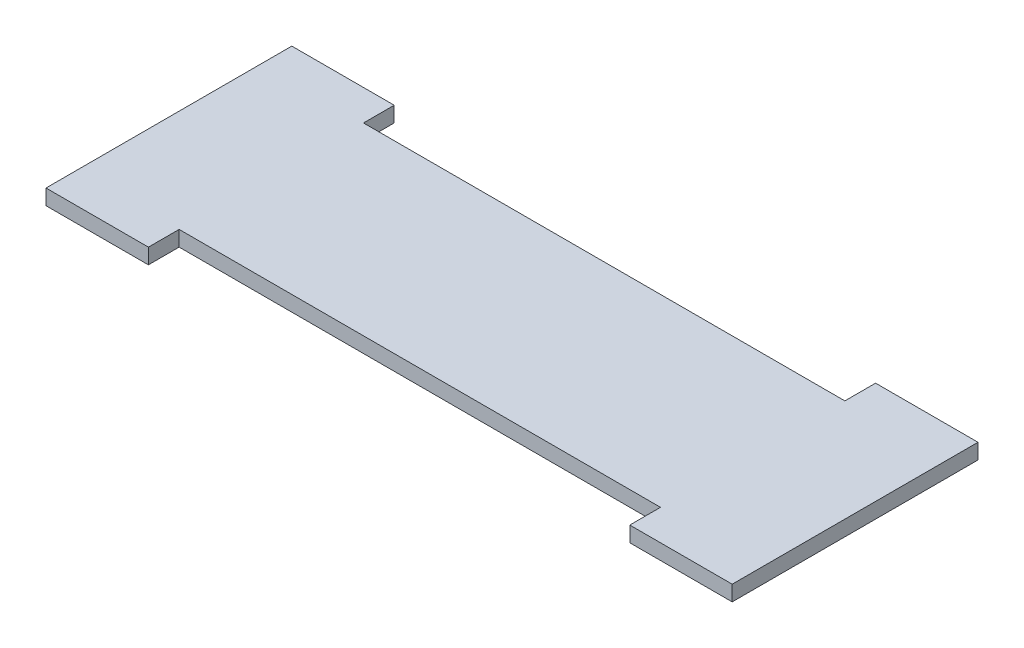
ISO-10303-21;
HEADER;
FILE_DESCRIPTION(('STEP AP214'),'2;1');
FILE_NAME('part.step','',(''),(''),'','','');
FILE_SCHEMA(('AUTOMOTIVE_DESIGN { 1 0 10303 214 1 1 1 1 }'));
ENDSEC;
DATA;
#1=APPLICATION_CONTEXT('core data for automotive mechanical design processes');
#2=APPLICATION_PROTOCOL_DEFINITION('international standard','automotive_design',2000,#1);
#3=PRODUCT_CONTEXT('',#1,'mechanical');
#4=PRODUCT('Part','Part','',(#3));
#5=PRODUCT_RELATED_PRODUCT_CATEGORY('part','',(#4));
#6=PRODUCT_DEFINITION_FORMATION('','',#4);
#7=PRODUCT_DEFINITION_CONTEXT('part definition',#1,'design');
#8=PRODUCT_DEFINITION('design','',#6,#7);
#9=PRODUCT_DEFINITION_SHAPE('','',#8);
#10=(LENGTH_UNIT() NAMED_UNIT(*) SI_UNIT(.MILLI.,.METRE.));
#11=(NAMED_UNIT(*) PLANE_ANGLE_UNIT() SI_UNIT($,.RADIAN.));
#12=(NAMED_UNIT(*) SI_UNIT($,.STERADIAN.) SOLID_ANGLE_UNIT());
#13=UNCERTAINTY_MEASURE_WITH_UNIT(LENGTH_MEASURE(1.E-05),#10,'distance_accuracy_value','');
#14=(GEOMETRIC_REPRESENTATION_CONTEXT(3) GLOBAL_UNCERTAINTY_ASSIGNED_CONTEXT((#13)) GLOBAL_UNIT_ASSIGNED_CONTEXT((#10,
#11,#12)) REPRESENTATION_CONTEXT('',''));
#15=CARTESIAN_POINT('',(0.,0.,0.));
#16=DIRECTION('',(0.,0.,1.));
#17=DIRECTION('',(1.,0.,0.));
#18=AXIS2_PLACEMENT_3D('',#15,#16,#17);
#19=CARTESIAN_POINT('',(0.,3.,0.));
#20=DIRECTION('',(1.,0.,0.));
#21=DIRECTION('',(0.,0.,-1.));
#22=AXIS2_PLACEMENT_3D('',#19,#20,#21);
#23=PLANE('',#22);
#24=DIRECTION('',(0.,0.,1.));
#25=VECTOR('',#24,1.);
#26=CARTESIAN_POINT('',(0.,0.,0.));
#27=LINE('',#26,#25);
#28=CARTESIAN_POINT('',(0.,0.,-42.));
#29=VERTEX_POINT('',#28);
#30=CARTESIAN_POINT('',(0.,0.,6.));
#31=VERTEX_POINT('',#30);
#32=EDGE_CURVE('E156',#29,#31,#27,.T.);
#33=ORIENTED_EDGE('',*,*,#32,.T.);
#34=DIRECTION('',(0.,-1.,0.));
#35=VECTOR('',#34,1.);
#36=CARTESIAN_POINT('',(0.,3.,6.));
#37=LINE('',#36,#35);
#38=CARTESIAN_POINT('',(0.,3.,6.));
#39=VERTEX_POINT('',#38);
#40=EDGE_CURVE('E11',#39,#31,#37,.T.);
#41=ORIENTED_EDGE('',*,*,#40,.F.);
#42=DIRECTION('',(0.,0.,1.));
#43=VECTOR('',#42,1.);
#44=CARTESIAN_POINT('',(0.,3.,0.));
#45=LINE('',#44,#43);
#46=CARTESIAN_POINT('',(0.,3.,-42.));
#47=VERTEX_POINT('',#46);
#48=EDGE_CURVE('E184',#47,#39,#45,.T.);
#49=ORIENTED_EDGE('',*,*,#48,.F.);
#50=DIRECTION('',(0.,-1.,0.));
#51=VECTOR('',#50,1.);
#52=CARTESIAN_POINT('',(0.,3.,-42.));
#53=LINE('',#52,#51);
#54=EDGE_CURVE('E52',#47,#29,#53,.T.);
#55=ORIENTED_EDGE('',*,*,#54,.T.);
#56=EDGE_LOOP('',(#33,#41,#49,#55));
#57=FACE_BOUND('',#56,.T.);
#58=ADVANCED_FACE('F36',(#57),#23,.F.);
#59=CARTESIAN_POINT('',(0.,3.,6.));
#60=DIRECTION('',(0.,0.,-1.));
#61=DIRECTION('',(-1.,0.,0.));
#62=AXIS2_PLACEMENT_3D('',#59,#60,#61);
#63=PLANE('',#62);
#64=DIRECTION('',(1.,0.,0.));
#65=VECTOR('',#64,1.);
#66=CARTESIAN_POINT('',(0.,0.,6.));
#67=LINE('',#66,#65);
#68=CARTESIAN_POINT('',(20.,0.,6.));
#69=VERTEX_POINT('',#68);
#70=EDGE_CURVE('E158',#31,#69,#67,.T.);
#71=ORIENTED_EDGE('',*,*,#70,.T.);
#72=DIRECTION('',(0.,-1.,0.));
#73=VECTOR('',#72,1.);
#74=CARTESIAN_POINT('',(20.,3.,6.));
#75=LINE('',#74,#73);
#76=CARTESIAN_POINT('',(20.,3.,6.));
#77=VERTEX_POINT('',#76);
#78=EDGE_CURVE('E44',#77,#69,#75,.T.);
#79=ORIENTED_EDGE('',*,*,#78,.F.);
#80=DIRECTION('',(1.,0.,0.));
#81=VECTOR('',#80,1.);
#82=CARTESIAN_POINT('',(0.,3.,6.));
#83=LINE('',#82,#81);
#84=EDGE_CURVE('E102',#39,#77,#83,.T.);
#85=ORIENTED_EDGE('',*,*,#84,.F.);
#86=ORIENTED_EDGE('',*,*,#40,.T.);
#87=EDGE_LOOP('',(#71,#79,#85,#86));
#88=FACE_BOUND('',#87,.T.);
#89=ADVANCED_FACE('F254',(#88),#63,.F.);
#90=CARTESIAN_POINT('',(20.,3.,0.));
#91=DIRECTION('',(-1.,0.,0.));
#92=DIRECTION('',(0.,0.,1.));
#93=AXIS2_PLACEMENT_3D('',#90,#91,#92);
#94=PLANE('',#93);
#95=DIRECTION('',(0.,0.,-1.));
#96=VECTOR('',#95,1.);
#97=CARTESIAN_POINT('',(20.,0.,0.));
#98=LINE('',#97,#96);
#99=CARTESIAN_POINT('',(20.,0.,0.));
#100=VERTEX_POINT('',#99);
#101=EDGE_CURVE('E160',#69,#100,#98,.T.);
#102=ORIENTED_EDGE('',*,*,#101,.T.);
#103=DIRECTION('',(0.,-1.,0.));
#104=VECTOR('',#103,1.);
#105=CARTESIAN_POINT('',(20.,3.,0.));
#106=LINE('',#105,#104);
#107=CARTESIAN_POINT('',(20.,3.,0.));
#108=VERTEX_POINT('',#107);
#109=EDGE_CURVE('E200',#108,#100,#106,.T.);
#110=ORIENTED_EDGE('',*,*,#109,.F.);
#111=DIRECTION('',(0.,0.,-1.));
#112=VECTOR('',#111,1.);
#113=CARTESIAN_POINT('',(20.,3.,0.));
#114=LINE('',#113,#112);
#115=EDGE_CURVE('E208',#77,#108,#114,.T.);
#116=ORIENTED_EDGE('',*,*,#115,.F.);
#117=ORIENTED_EDGE('',*,*,#78,.T.);
#118=EDGE_LOOP('',(#102,#110,#116,#117));
#119=FACE_BOUND('',#118,.T.);
#120=ADVANCED_FACE('F206',(#119),#94,.F.);
#121=CARTESIAN_POINT('',(0.,3.,0.));
#122=DIRECTION('',(0.,0.,-1.));
#123=DIRECTION('',(-1.,0.,0.));
#124=AXIS2_PLACEMENT_3D('',#121,#122,#123);
#125=PLANE('',#124);
#126=DIRECTION('',(1.,0.,0.));
#127=VECTOR('',#126,1.);
#128=CARTESIAN_POINT('',(0.,0.,0.));
#129=LINE('',#128,#127);
#130=CARTESIAN_POINT('',(114.,0.,0.));
#131=VERTEX_POINT('',#130);
#132=EDGE_CURVE('E162',#100,#131,#129,.T.);
#133=ORIENTED_EDGE('',*,*,#132,.T.);
#134=DIRECTION('',(0.,-1.,0.));
#135=VECTOR('',#134,1.);
#136=CARTESIAN_POINT('',(114.,3.,0.));
#137=LINE('',#136,#135);
#138=CARTESIAN_POINT('',(114.,3.,0.));
#139=VERTEX_POINT('',#138);
#140=EDGE_CURVE('E198',#139,#131,#137,.T.);
#141=ORIENTED_EDGE('',*,*,#140,.F.);
#142=DIRECTION('',(1.,0.,0.));
#143=VECTOR('',#142,1.);
#144=CARTESIAN_POINT('',(0.,3.,0.));
#145=LINE('',#144,#143);
#146=EDGE_CURVE('E218',#108,#139,#145,.T.);
#147=ORIENTED_EDGE('',*,*,#146,.F.);
#148=ORIENTED_EDGE('',*,*,#109,.T.);
#149=EDGE_LOOP('',(#133,#141,#147,#148));
#150=FACE_BOUND('',#149,.T.);
#151=ADVANCED_FACE('F215',(#150),#125,.F.);
#152=CARTESIAN_POINT('',(114.,3.,0.));
#153=DIRECTION('',(-1.,0.,0.));
#154=DIRECTION('',(0.,0.,1.));
#155=AXIS2_PLACEMENT_3D('',#152,#153,#154);
#156=PLANE('',#155);
#157=DIRECTION('',(0.,0.,-1.));
#158=VECTOR('',#157,1.);
#159=CARTESIAN_POINT('',(114.,0.,0.));
#160=LINE('',#159,#158);
#161=CARTESIAN_POINT('',(114.,0.,6.));
#162=VERTEX_POINT('',#161);
#163=EDGE_CURVE('E165',#162,#131,#160,.T.);
#164=ORIENTED_EDGE('',*,*,#163,.F.);
#165=DIRECTION('',(0.,-1.,0.));
#166=VECTOR('',#165,1.);
#167=CARTESIAN_POINT('',(114.,3.,6.));
#168=LINE('',#167,#166);
#169=CARTESIAN_POINT('',(114.,3.,6.));
#170=VERTEX_POINT('',#169);
#171=EDGE_CURVE('E196',#170,#162,#168,.T.);
#172=ORIENTED_EDGE('',*,*,#171,.F.);
#173=DIRECTION('',(0.,0.,-1.));
#174=VECTOR('',#173,1.);
#175=CARTESIAN_POINT('',(114.,3.,0.));
#176=LINE('',#175,#174);
#177=EDGE_CURVE('E220',#170,#139,#176,.T.);
#178=ORIENTED_EDGE('',*,*,#177,.T.);
#179=ORIENTED_EDGE('',*,*,#140,.T.);
#180=EDGE_LOOP('',(#164,#172,#178,#179));
#181=FACE_BOUND('',#180,.T.);
#182=ADVANCED_FACE('F267',(#181),#156,.T.);
#183=CARTESIAN_POINT('',(0.,3.,6.));
#184=DIRECTION('',(0.,0.,1.));
#185=DIRECTION('',(1.,0.,0.));
#186=AXIS2_PLACEMENT_3D('',#183,#184,#185);
#187=PLANE('',#186);
#188=DIRECTION('',(-1.,0.,0.));
#189=VECTOR('',#188,1.);
#190=CARTESIAN_POINT('',(0.,0.,6.));
#191=LINE('',#190,#189);
#192=CARTESIAN_POINT('',(134.,0.,6.));
#193=VERTEX_POINT('',#192);
#194=EDGE_CURVE('E168',#193,#162,#191,.T.);
#195=ORIENTED_EDGE('',*,*,#194,.F.);
#196=DIRECTION('',(0.,-1.,0.));
#197=VECTOR('',#196,1.);
#198=CARTESIAN_POINT('',(134.,3.,6.));
#199=LINE('',#198,#197);
#200=CARTESIAN_POINT('',(134.,3.,6.));
#201=VERTEX_POINT('',#200);
#202=EDGE_CURVE('E194',#201,#193,#199,.T.);
#203=ORIENTED_EDGE('',*,*,#202,.F.);
#204=DIRECTION('',(-1.,0.,0.));
#205=VECTOR('',#204,1.);
#206=CARTESIAN_POINT('',(0.,3.,6.));
#207=LINE('',#206,#205);
#208=EDGE_CURVE('E222',#201,#170,#207,.T.);
#209=ORIENTED_EDGE('',*,*,#208,.T.);
#210=ORIENTED_EDGE('',*,*,#171,.T.);
#211=EDGE_LOOP('',(#195,#203,#209,#210));
#212=FACE_BOUND('',#211,.T.);
#213=ADVANCED_FACE('F270',(#212),#187,.T.);
#214=CARTESIAN_POINT('',(134.,3.,0.));
#215=DIRECTION('',(-1.,0.,0.));
#216=DIRECTION('',(0.,0.,1.));
#217=AXIS2_PLACEMENT_3D('',#214,#215,#216);
#218=PLANE('',#217);
#219=DIRECTION('',(0.,0.,-1.));
#220=VECTOR('',#219,1.);
#221=CARTESIAN_POINT('',(134.,0.,0.));
#222=LINE('',#221,#220);
#223=CARTESIAN_POINT('',(134.,0.,-42.));
#224=VERTEX_POINT('',#223);
#225=EDGE_CURVE('E171',#193,#224,#222,.T.);
#226=ORIENTED_EDGE('',*,*,#225,.T.);
#227=DIRECTION('',(0.,-1.,0.));
#228=VECTOR('',#227,1.);
#229=CARTESIAN_POINT('',(134.,3.,-42.));
#230=LINE('',#229,#228);
#231=CARTESIAN_POINT('',(134.,3.,-42.));
#232=VERTEX_POINT('',#231);
#233=EDGE_CURVE('E191',#232,#224,#230,.T.);
#234=ORIENTED_EDGE('',*,*,#233,.F.);
#235=DIRECTION('',(0.,0.,-1.));
#236=VECTOR('',#235,1.);
#237=CARTESIAN_POINT('',(134.,3.,0.));
#238=LINE('',#237,#236);
#239=EDGE_CURVE('E229',#201,#232,#238,.T.);
#240=ORIENTED_EDGE('',*,*,#239,.F.);
#241=ORIENTED_EDGE('',*,*,#202,.T.);
#242=EDGE_LOOP('',(#226,#234,#240,#241));
#243=FACE_BOUND('',#242,.T.);
#244=ADVANCED_FACE('F274',(#243),#218,.F.);
#245=CARTESIAN_POINT('',(0.,3.,-42.));
#246=DIRECTION('',(0.,0.,1.));
#247=DIRECTION('',(1.,0.,0.));
#248=AXIS2_PLACEMENT_3D('',#245,#246,#247);
#249=PLANE('',#248);
#250=DIRECTION('',(-1.,0.,0.));
#251=VECTOR('',#250,1.);
#252=CARTESIAN_POINT('',(0.,0.,-42.));
#253=LINE('',#252,#251);
#254=CARTESIAN_POINT('',(114.,0.,-42.));
#255=VERTEX_POINT('',#254);
#256=EDGE_CURVE('E173',#224,#255,#253,.T.);
#257=ORIENTED_EDGE('',*,*,#256,.T.);
#258=DIRECTION('',(0.,-1.,0.));
#259=VECTOR('',#258,1.);
#260=CARTESIAN_POINT('',(114.,3.,-42.));
#261=LINE('',#260,#259);
#262=CARTESIAN_POINT('',(114.,3.,-42.));
#263=VERTEX_POINT('',#262);
#264=EDGE_CURVE('E188',#263,#255,#261,.T.);
#265=ORIENTED_EDGE('',*,*,#264,.F.);
#266=DIRECTION('',(-1.,0.,0.));
#267=VECTOR('',#266,1.);
#268=CARTESIAN_POINT('',(0.,3.,-42.));
#269=LINE('',#268,#267);
#270=EDGE_CURVE('E231',#232,#263,#269,.T.);
#271=ORIENTED_EDGE('',*,*,#270,.F.);
#272=ORIENTED_EDGE('',*,*,#233,.T.);
#273=EDGE_LOOP('',(#257,#265,#271,#272));
#274=FACE_BOUND('',#273,.T.);
#275=ADVANCED_FACE('F238',(#274),#249,.F.);
#276=CARTESIAN_POINT('',(114.,3.,0.));
#277=DIRECTION('',(1.,0.,0.));
#278=DIRECTION('',(0.,0.,-1.));
#279=AXIS2_PLACEMENT_3D('',#276,#277,#278);
#280=PLANE('',#279);
#281=DIRECTION('',(0.,0.,1.));
#282=VECTOR('',#281,1.);
#283=CARTESIAN_POINT('',(114.,0.,0.));
#284=LINE('',#283,#282);
#285=CARTESIAN_POINT('',(114.,0.,-36.));
#286=VERTEX_POINT('',#285);
#287=EDGE_CURVE('E175',#255,#286,#284,.T.);
#288=ORIENTED_EDGE('',*,*,#287,.T.);
#289=DIRECTION('',(0.,-1.,0.));
#290=VECTOR('',#289,1.);
#291=CARTESIAN_POINT('',(114.,3.,-36.));
#292=LINE('',#291,#290);
#293=CARTESIAN_POINT('',(114.,3.,-36.));
#294=VERTEX_POINT('',#293);
#295=EDGE_CURVE('E139',#294,#286,#292,.T.);
#296=ORIENTED_EDGE('',*,*,#295,.F.);
#297=DIRECTION('',(0.,0.,1.));
#298=VECTOR('',#297,1.);
#299=CARTESIAN_POINT('',(114.,3.,0.));
#300=LINE('',#299,#298);
#301=EDGE_CURVE('E147',#263,#294,#300,.T.);
#302=ORIENTED_EDGE('',*,*,#301,.F.);
#303=ORIENTED_EDGE('',*,*,#264,.T.);
#304=EDGE_LOOP('',(#288,#296,#302,#303));
#305=FACE_BOUND('',#304,.T.);
#306=ADVANCED_FACE('F242',(#305),#280,.F.);
#307=CARTESIAN_POINT('',(0.,3.,-36.));
#308=DIRECTION('',(0.,0.,-1.));
#309=DIRECTION('',(-1.,0.,0.));
#310=AXIS2_PLACEMENT_3D('',#307,#308,#309);
#311=PLANE('',#310);
#312=DIRECTION('',(1.,0.,0.));
#313=VECTOR('',#312,1.);
#314=CARTESIAN_POINT('',(0.,0.,-36.));
#315=LINE('',#314,#313);
#316=CARTESIAN_POINT('',(20.,0.,-36.));
#317=VERTEX_POINT('',#316);
#318=EDGE_CURVE('E135',#317,#286,#315,.T.);
#319=ORIENTED_EDGE('',*,*,#318,.F.);
#320=DIRECTION('',(0.,-1.,0.));
#321=VECTOR('',#320,1.);
#322=CARTESIAN_POINT('',(20.,3.,-36.));
#323=LINE('',#322,#321);
#324=CARTESIAN_POINT('',(20.,3.,-36.));
#325=VERTEX_POINT('',#324);
#326=EDGE_CURVE('E130',#325,#317,#323,.T.);
#327=ORIENTED_EDGE('',*,*,#326,.F.);
#328=DIRECTION('',(1.,0.,0.));
#329=VECTOR('',#328,1.);
#330=CARTESIAN_POINT('',(0.,3.,-36.));
#331=LINE('',#330,#329);
#332=EDGE_CURVE('E133',#325,#294,#331,.T.);
#333=ORIENTED_EDGE('',*,*,#332,.T.);
#334=ORIENTED_EDGE('',*,*,#295,.T.);
#335=EDGE_LOOP('',(#319,#327,#333,#334));
#336=FACE_BOUND('',#335,.T.);
#337=ADVANCED_FACE('F132',(#336),#311,.T.);
#338=CARTESIAN_POINT('',(20.,3.,0.));
#339=DIRECTION('',(1.,0.,0.));
#340=DIRECTION('',(0.,0.,-1.));
#341=AXIS2_PLACEMENT_3D('',#338,#339,#340);
#342=PLANE('',#341);
#343=DIRECTION('',(0.,0.,1.));
#344=VECTOR('',#343,1.);
#345=CARTESIAN_POINT('',(20.,0.,0.));
#346=LINE('',#345,#344);
#347=CARTESIAN_POINT('',(20.,0.,-42.));
#348=VERTEX_POINT('',#347);
#349=EDGE_CURVE('E179',#348,#317,#346,.T.);
#350=ORIENTED_EDGE('',*,*,#349,.F.);
#351=DIRECTION('',(0.,-1.,0.));
#352=VECTOR('',#351,1.);
#353=CARTESIAN_POINT('',(20.,3.,-42.));
#354=LINE('',#353,#352);
#355=CARTESIAN_POINT('',(20.,3.,-42.));
#356=VERTEX_POINT('',#355);
#357=EDGE_CURVE('E90',#356,#348,#354,.T.);
#358=ORIENTED_EDGE('',*,*,#357,.F.);
#359=DIRECTION('',(0.,0.,1.));
#360=VECTOR('',#359,1.);
#361=CARTESIAN_POINT('',(20.,3.,0.));
#362=LINE('',#361,#360);
#363=EDGE_CURVE('E145',#356,#325,#362,.T.);
#364=ORIENTED_EDGE('',*,*,#363,.T.);
#365=ORIENTED_EDGE('',*,*,#326,.T.);
#366=EDGE_LOOP('',(#350,#358,#364,#365));
#367=FACE_BOUND('',#366,.T.);
#368=ADVANCED_FACE('F150',(#367),#342,.T.);
#369=CARTESIAN_POINT('',(0.,3.,-42.));
#370=DIRECTION('',(0.,0.,-1.));
#371=DIRECTION('',(-1.,0.,0.));
#372=AXIS2_PLACEMENT_3D('',#369,#370,#371);
#373=PLANE('',#372);
#374=DIRECTION('',(1.,0.,0.));
#375=VECTOR('',#374,1.);
#376=CARTESIAN_POINT('',(0.,0.,-42.));
#377=LINE('',#376,#375);
#378=EDGE_CURVE('E181',#29,#348,#377,.T.);
#379=ORIENTED_EDGE('',*,*,#378,.F.);
#380=ORIENTED_EDGE('',*,*,#54,.F.);
#381=DIRECTION('',(1.,0.,0.));
#382=VECTOR('',#381,1.);
#383=CARTESIAN_POINT('',(0.,3.,-42.));
#384=LINE('',#383,#382);
#385=EDGE_CURVE('E151',#47,#356,#384,.T.);
#386=ORIENTED_EDGE('',*,*,#385,.T.);
#387=ORIENTED_EDGE('',*,*,#357,.T.);
#388=EDGE_LOOP('',(#379,#380,#386,#387));
#389=FACE_BOUND('',#388,.T.);
#390=ADVANCED_FACE('F243',(#389),#373,.T.);
#391=CARTESIAN_POINT('',(0.,3.,0.));
#392=DIRECTION('',(0.,1.,0.));
#393=DIRECTION('',(0.,0.,1.));
#394=AXIS2_PLACEMENT_3D('',#391,#392,#393);
#395=PLANE('',#394);
#396=ORIENTED_EDGE('',*,*,#48,.T.);
#397=ORIENTED_EDGE('',*,*,#84,.T.);
#398=ORIENTED_EDGE('',*,*,#115,.T.);
#399=ORIENTED_EDGE('',*,*,#146,.T.);
#400=ORIENTED_EDGE('',*,*,#177,.F.);
#401=ORIENTED_EDGE('',*,*,#208,.F.);
#402=ORIENTED_EDGE('',*,*,#239,.T.);
#403=ORIENTED_EDGE('',*,*,#270,.T.);
#404=ORIENTED_EDGE('',*,*,#301,.T.);
#405=ORIENTED_EDGE('',*,*,#332,.F.);
#406=ORIENTED_EDGE('',*,*,#363,.F.);
#407=ORIENTED_EDGE('',*,*,#385,.F.);
#408=EDGE_LOOP('',(#396,#397,#398,#399,#400,#401,#402,#403,#404,#405,#406,#407));
#409=FACE_BOUND('',#408,.T.);
#410=ADVANCED_FACE('F143',(#409),#395,.T.);
#411=CARTESIAN_POINT('',(0.,0.,0.));
#412=DIRECTION('',(0.,1.,0.));
#413=DIRECTION('',(0.,0.,1.));
#414=AXIS2_PLACEMENT_3D('',#411,#412,#413);
#415=PLANE('',#414);
#416=ORIENTED_EDGE('',*,*,#32,.F.);
#417=ORIENTED_EDGE('',*,*,#378,.T.);
#418=ORIENTED_EDGE('',*,*,#349,.T.);
#419=ORIENTED_EDGE('',*,*,#318,.T.);
#420=ORIENTED_EDGE('',*,*,#287,.F.);
#421=ORIENTED_EDGE('',*,*,#256,.F.);
#422=ORIENTED_EDGE('',*,*,#225,.F.);
#423=ORIENTED_EDGE('',*,*,#194,.T.);
#424=ORIENTED_EDGE('',*,*,#163,.T.);
#425=ORIENTED_EDGE('',*,*,#132,.F.);
#426=ORIENTED_EDGE('',*,*,#101,.F.);
#427=ORIENTED_EDGE('',*,*,#70,.F.);
#428=EDGE_LOOP('',(#416,#417,#418,#419,#420,#421,#422,#423,#424,#425,#426,#427));
#429=FACE_BOUND('',#428,.T.);
#430=ADVANCED_FACE('F211',(#429),#415,.F.);
#431=CLOSED_SHELL('',(#58,#89,#120,#151,#182,#213,#244,#275,#306,#337,#368,#390,#410,#430));
#432=MANIFOLD_SOLID_BREP('B2',#431);
#433=ADVANCED_BREP_SHAPE_REPRESENTATION('',(#18,#432),#14);
#434=SHAPE_DEFINITION_REPRESENTATION(#9,#433);
ENDSEC;
END-ISO-10303-21;
